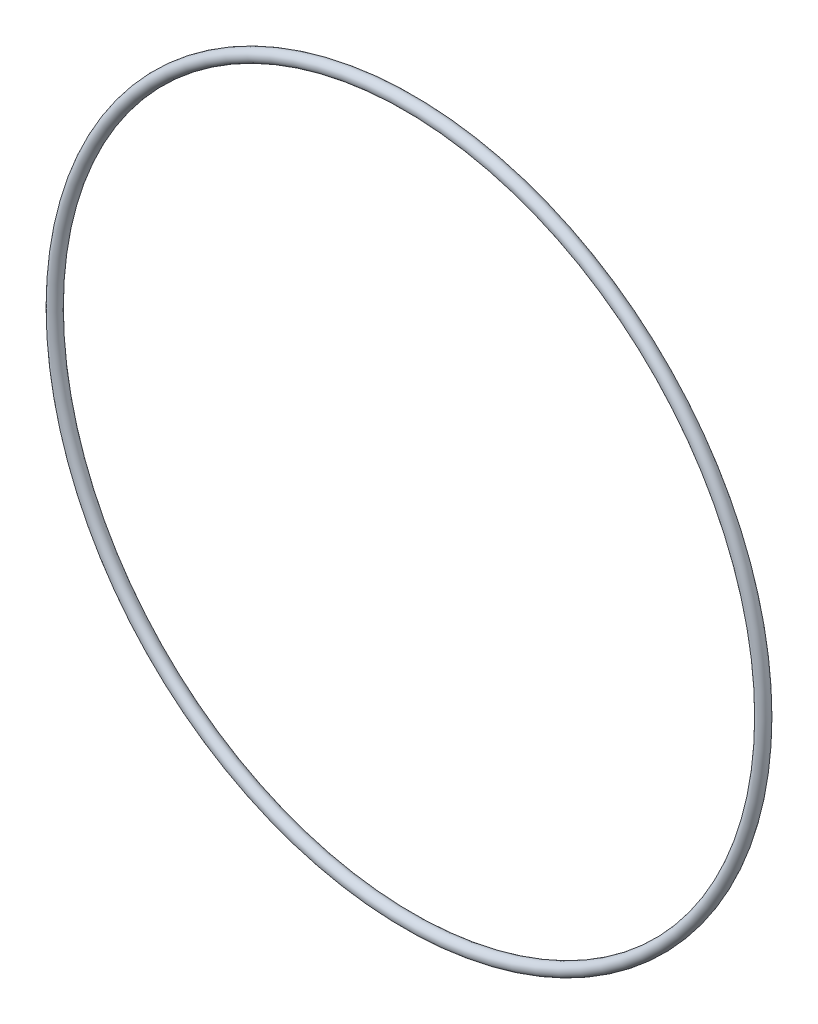
ISO-10303-21;
HEADER;
FILE_DESCRIPTION(('STEP AP214'),'2;1');
FILE_NAME('part.step','',(''),(''),'','','');
FILE_SCHEMA(('AUTOMOTIVE_DESIGN { 1 0 10303 214 1 1 1 1 }'));
ENDSEC;
DATA;
#1=APPLICATION_CONTEXT('core data for automotive mechanical design processes');
#2=APPLICATION_PROTOCOL_DEFINITION('international standard','automotive_design',2000,#1);
#3=PRODUCT_CONTEXT('',#1,'mechanical');
#4=PRODUCT('Part','Part','',(#3));
#5=PRODUCT_RELATED_PRODUCT_CATEGORY('part','',(#4));
#6=PRODUCT_DEFINITION_FORMATION('','',#4);
#7=PRODUCT_DEFINITION_CONTEXT('part definition',#1,'design');
#8=PRODUCT_DEFINITION('design','',#6,#7);
#9=PRODUCT_DEFINITION_SHAPE('','',#8);
#10=(LENGTH_UNIT() NAMED_UNIT(*) SI_UNIT(.MILLI.,.METRE.));
#11=(NAMED_UNIT(*) PLANE_ANGLE_UNIT() SI_UNIT($,.RADIAN.));
#12=(NAMED_UNIT(*) SI_UNIT($,.STERADIAN.) SOLID_ANGLE_UNIT());
#13=UNCERTAINTY_MEASURE_WITH_UNIT(LENGTH_MEASURE(1.E-05),#10,'distance_accuracy_value','');
#14=(GEOMETRIC_REPRESENTATION_CONTEXT(3) GLOBAL_UNCERTAINTY_ASSIGNED_CONTEXT((#13)) GLOBAL_UNIT_ASSIGNED_CONTEXT((#10,
#11,#12)) REPRESENTATION_CONTEXT('',''));
#15=CARTESIAN_POINT('',(0.,0.,0.));
#16=DIRECTION('',(0.,0.,1.));
#17=DIRECTION('',(1.,0.,0.));
#18=AXIS2_PLACEMENT_3D('',#15,#16,#17);
#19=CARTESIAN_POINT('',(0.,0.,0.));
#20=DIRECTION('',(0.,0.,1.));
#21=DIRECTION('',(1.,0.,0.));
#22=AXIS2_PLACEMENT_3D('',#19,#20,#21);
#23=TOROIDAL_SURFACE('',#22,51.5493,0.889000000000003);
#24=CARTESIAN_POINT('',(52.4383,0.,0.));
#25=VERTEX_POINT('',#24);
#26=VERTEX_LOOP('',#25);
#27=FACE_BOUND('',#26,.T.);
#28=ADVANCED_FACE('F37',(#27),#23,.T.);
#29=CLOSED_SHELL('',(#28));
#30=MANIFOLD_SOLID_BREP('B2',#29);
#31=ADVANCED_BREP_SHAPE_REPRESENTATION('',(#18,#30),#14);
#32=SHAPE_DEFINITION_REPRESENTATION(#9,#31);
ENDSEC;
END-ISO-10303-21;
